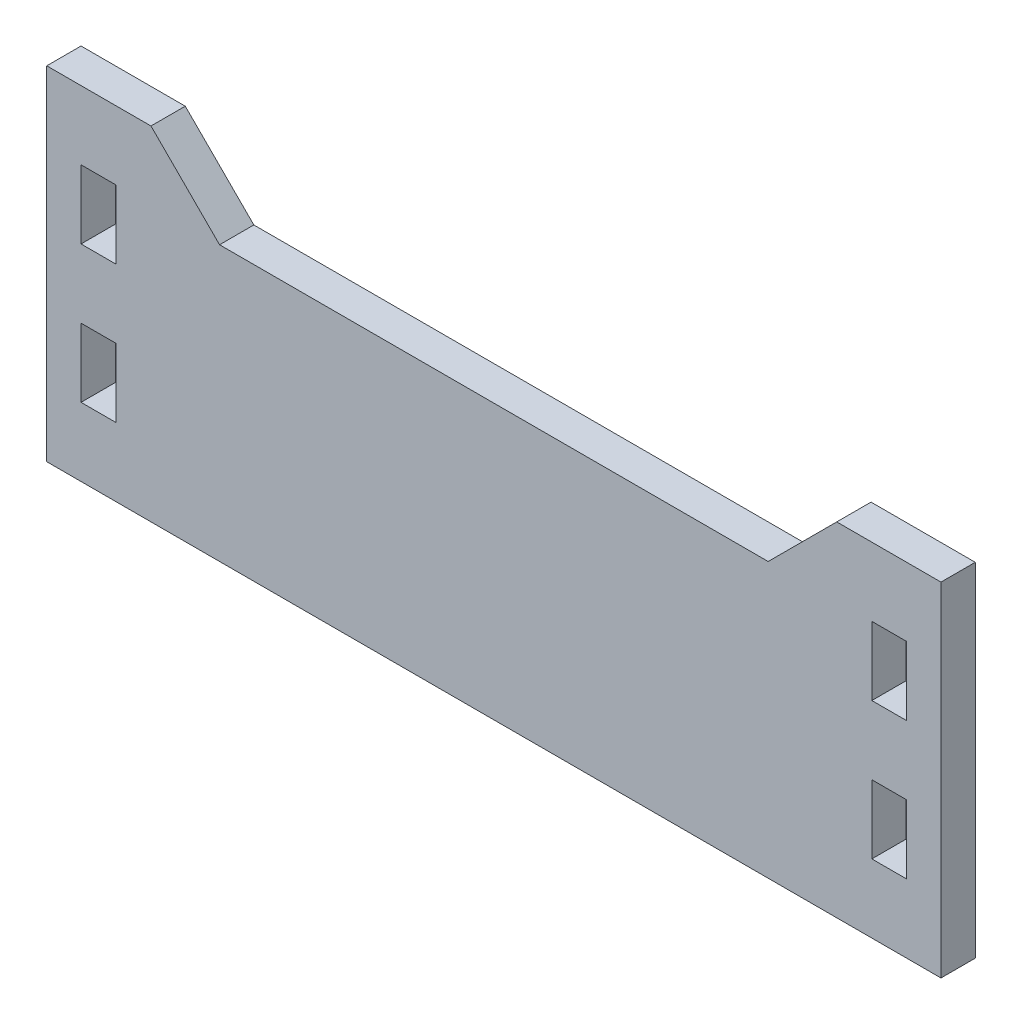
ISO-10303-21;
HEADER;
FILE_DESCRIPTION(('STEP AP214'),'2;1');
FILE_NAME('part.step','',(''),(''),'','','');
FILE_SCHEMA(('AUTOMOTIVE_DESIGN { 1 0 10303 214 1 1 1 1 }'));
ENDSEC;
DATA;
#1=APPLICATION_CONTEXT('core data for automotive mechanical design processes');
#2=APPLICATION_PROTOCOL_DEFINITION('international standard','automotive_design',2000,#1);
#3=PRODUCT_CONTEXT('',#1,'mechanical');
#4=PRODUCT('Part','Part','',(#3));
#5=PRODUCT_RELATED_PRODUCT_CATEGORY('part','',(#4));
#6=PRODUCT_DEFINITION_FORMATION('','',#4);
#7=PRODUCT_DEFINITION_CONTEXT('part definition',#1,'design');
#8=PRODUCT_DEFINITION('design','',#6,#7);
#9=PRODUCT_DEFINITION_SHAPE('','',#8);
#10=(LENGTH_UNIT() NAMED_UNIT(*) SI_UNIT(.MILLI.,.METRE.));
#11=(NAMED_UNIT(*) PLANE_ANGLE_UNIT() SI_UNIT($,.RADIAN.));
#12=(NAMED_UNIT(*) SI_UNIT($,.STERADIAN.) SOLID_ANGLE_UNIT());
#13=UNCERTAINTY_MEASURE_WITH_UNIT(LENGTH_MEASURE(1.E-05),#10,'distance_accuracy_value','');
#14=(GEOMETRIC_REPRESENTATION_CONTEXT(3) GLOBAL_UNCERTAINTY_ASSIGNED_CONTEXT((#13)) GLOBAL_UNIT_ASSIGNED_CONTEXT((#10,
#11,#12)) REPRESENTATION_CONTEXT('',''));
#15=CARTESIAN_POINT('',(0.,0.,0.));
#16=DIRECTION('',(0.,0.,1.));
#17=DIRECTION('',(1.,0.,0.));
#18=AXIS2_PLACEMENT_3D('',#15,#16,#17);
#19=CARTESIAN_POINT('',(-41.402,15.875,3.175));
#20=DIRECTION('',(0.,-1.,0.));
#21=DIRECTION('',(0.,0.,-1.));
#22=AXIS2_PLACEMENT_3D('',#19,#20,#21);
#23=PLANE('',#22);
#24=DIRECTION('',(0.,0.,1.));
#25=VECTOR('',#24,1.);
#26=CARTESIAN_POINT('',(31.75,15.875,0.));
#27=LINE('',#26,#25);
#28=CARTESIAN_POINT('',(31.75,15.875,0.));
#29=VERTEX_POINT('',#28);
#30=CARTESIAN_POINT('',(31.75,15.875,3.175));
#31=VERTEX_POINT('',#30);
#32=EDGE_CURVE('E212',#29,#31,#27,.T.);
#33=ORIENTED_EDGE('',*,*,#32,.T.);
#34=DIRECTION('',(-1.,0.,0.));
#35=VECTOR('',#34,1.);
#36=CARTESIAN_POINT('',(-41.402,15.875,3.175));
#37=LINE('',#36,#35);
#38=CARTESIAN_POINT('',(41.402,15.875,3.175));
#39=VERTEX_POINT('',#38);
#40=EDGE_CURVE('E358',#39,#31,#37,.T.);
#41=ORIENTED_EDGE('',*,*,#40,.F.);
#42=DIRECTION('',(0.,0.,-1.));
#43=VECTOR('',#42,1.);
#44=CARTESIAN_POINT('',(41.402,15.875,3.175));
#45=LINE('',#44,#43);
#46=CARTESIAN_POINT('',(41.402,15.875,0.));
#47=VERTEX_POINT('',#46);
#48=EDGE_CURVE('E11',#39,#47,#45,.T.);
#49=ORIENTED_EDGE('',*,*,#48,.T.);
#50=DIRECTION('',(-1.,0.,0.));
#51=VECTOR('',#50,1.);
#52=CARTESIAN_POINT('',(-41.402,15.875,0.));
#53=LINE('',#52,#51);
#54=EDGE_CURVE('E369',#47,#29,#53,.T.);
#55=ORIENTED_EDGE('',*,*,#54,.T.);
#56=EDGE_LOOP('',(#33,#41,#49,#55));
#57=FACE_BOUND('',#56,.T.);
#58=ADVANCED_FACE('F33',(#57),#23,.F.);
#59=CARTESIAN_POINT('',(41.402,15.875,3.175));
#60=DIRECTION('',(0.,0.,-1.));
#61=DIRECTION('',(-1.,0.,0.));
#62=AXIS2_PLACEMENT_3D('',#59,#60,#61);
#63=PLANE('',#62);
#64=DIRECTION('',(0.,1.,0.));
#65=VECTOR('',#64,1.);
#66=CARTESIAN_POINT('',(35.0012,-3.175,3.175));
#67=LINE('',#66,#65);
#68=CARTESIAN_POINT('',(35.0012,-9.525,3.175));
#69=VERTEX_POINT('',#68);
#70=CARTESIAN_POINT('',(35.0012,-3.175,3.175));
#71=VERTEX_POINT('',#70);
#72=EDGE_CURVE('E56',#69,#71,#67,.T.);
#73=ORIENTED_EDGE('',*,*,#72,.T.);
#74=DIRECTION('',(1.,0.,0.));
#75=VECTOR('',#74,1.);
#76=CARTESIAN_POINT('',(38.227,-3.175,3.175));
#77=LINE('',#76,#75);
#78=CARTESIAN_POINT('',(38.227,-3.175,3.175));
#79=VERTEX_POINT('',#78);
#80=EDGE_CURVE('E233',#71,#79,#77,.T.);
#81=ORIENTED_EDGE('',*,*,#80,.T.);
#82=DIRECTION('',(0.,-1.,0.));
#83=VECTOR('',#82,1.);
#84=CARTESIAN_POINT('',(38.227,-3.175,3.175));
#85=LINE('',#84,#83);
#86=CARTESIAN_POINT('',(38.227,-9.525,3.175));
#87=VERTEX_POINT('',#86);
#88=EDGE_CURVE('E245',#79,#87,#85,.T.);
#89=ORIENTED_EDGE('',*,*,#88,.T.);
#90=DIRECTION('',(-1.,0.,0.));
#91=VECTOR('',#90,1.);
#92=CARTESIAN_POINT('',(38.227,-9.525,3.175));
#93=LINE('',#92,#91);
#94=EDGE_CURVE('E242',#87,#69,#93,.T.);
#95=ORIENTED_EDGE('',*,*,#94,.T.);
#96=EDGE_LOOP('',(#73,#81,#89,#95));
#97=FACE_BOUND('',#96,.T.);
#98=DIRECTION('',(-1.,0.,0.));
#99=VECTOR('',#98,1.);
#100=CARTESIAN_POINT('',(-38.227,9.525,3.175));
#101=LINE('',#100,#99);
#102=CARTESIAN_POINT('',(-35.0012,9.525,3.175));
#103=VERTEX_POINT('',#102);
#104=CARTESIAN_POINT('',(-38.227,9.525,3.175));
#105=VERTEX_POINT('',#104);
#106=EDGE_CURVE('E336',#103,#105,#101,.T.);
#107=ORIENTED_EDGE('',*,*,#106,.F.);
#108=DIRECTION('',(0.,1.,0.));
#109=VECTOR('',#108,1.);
#110=CARTESIAN_POINT('',(-35.0012,9.525,3.175));
#111=LINE('',#110,#109);
#112=CARTESIAN_POINT('',(-35.0012,3.175,3.175));
#113=VERTEX_POINT('',#112);
#114=EDGE_CURVE('E314',#113,#103,#111,.T.);
#115=ORIENTED_EDGE('',*,*,#114,.F.);
#116=DIRECTION('',(1.,0.,0.));
#117=VECTOR('',#116,1.);
#118=CARTESIAN_POINT('',(-38.227,3.175,3.175));
#119=LINE('',#118,#117);
#120=CARTESIAN_POINT('',(-38.227,3.175,3.175));
#121=VERTEX_POINT('',#120);
#122=EDGE_CURVE('E325',#121,#113,#119,.T.);
#123=ORIENTED_EDGE('',*,*,#122,.F.);
#124=DIRECTION('',(0.,-1.,0.));
#125=VECTOR('',#124,1.);
#126=CARTESIAN_POINT('',(-38.227,9.525,3.175));
#127=LINE('',#126,#125);
#128=EDGE_CURVE('E339',#105,#121,#127,.T.);
#129=ORIENTED_EDGE('',*,*,#128,.F.);
#130=EDGE_LOOP('',(#107,#115,#123,#129));
#131=FACE_BOUND('',#130,.T.);
#132=DIRECTION('',(-1.,0.,0.));
#133=VECTOR('',#132,1.);
#134=CARTESIAN_POINT('',(-38.227,-3.175,3.175));
#135=LINE('',#134,#133);
#136=CARTESIAN_POINT('',(-35.0012,-3.175,3.175));
#137=VERTEX_POINT('',#136);
#138=CARTESIAN_POINT('',(-38.227,-3.175,3.175));
#139=VERTEX_POINT('',#138);
#140=EDGE_CURVE('E304',#137,#139,#135,.T.);
#141=ORIENTED_EDGE('',*,*,#140,.F.);
#142=DIRECTION('',(0.,1.,0.));
#143=VECTOR('',#142,1.);
#144=CARTESIAN_POINT('',(-35.0012,-3.175,3.175));
#145=LINE('',#144,#143);
#146=CARTESIAN_POINT('',(-35.0012,-9.525,3.175));
#147=VERTEX_POINT('',#146);
#148=EDGE_CURVE('E282',#147,#137,#145,.T.);
#149=ORIENTED_EDGE('',*,*,#148,.F.);
#150=DIRECTION('',(1.,0.,0.));
#151=VECTOR('',#150,1.);
#152=CARTESIAN_POINT('',(-38.227,-9.525,3.175));
#153=LINE('',#152,#151);
#154=CARTESIAN_POINT('',(-38.227,-9.525,3.175));
#155=VERTEX_POINT('',#154);
#156=EDGE_CURVE('E293',#155,#147,#153,.T.);
#157=ORIENTED_EDGE('',*,*,#156,.F.);
#158=DIRECTION('',(0.,-1.,0.));
#159=VECTOR('',#158,1.);
#160=CARTESIAN_POINT('',(-38.227,-3.175,3.175));
#161=LINE('',#160,#159);
#162=EDGE_CURVE('E307',#139,#155,#161,.T.);
#163=ORIENTED_EDGE('',*,*,#162,.F.);
#164=EDGE_LOOP('',(#141,#149,#157,#163));
#165=FACE_BOUND('',#164,.T.);
#166=DIRECTION('',(0.,1.,0.));
#167=VECTOR('',#166,1.);
#168=CARTESIAN_POINT('',(35.0012,9.525,3.175));
#169=LINE('',#168,#167);
#170=CARTESIAN_POINT('',(35.0012,3.175,3.175));
#171=VERTEX_POINT('',#170);
#172=CARTESIAN_POINT('',(35.0012,9.525,3.175));
#173=VERTEX_POINT('',#172);
#174=EDGE_CURVE('E252',#171,#173,#169,.T.);
#175=ORIENTED_EDGE('',*,*,#174,.T.);
#176=DIRECTION('',(1.,0.,0.));
#177=VECTOR('',#176,1.);
#178=CARTESIAN_POINT('',(38.227,9.525,3.175));
#179=LINE('',#178,#177);
#180=CARTESIAN_POINT('',(38.227,9.525,3.175));
#181=VERTEX_POINT('',#180);
#182=EDGE_CURVE('E261',#173,#181,#179,.T.);
#183=ORIENTED_EDGE('',*,*,#182,.T.);
#184=DIRECTION('',(0.,-1.,0.));
#185=VECTOR('',#184,1.);
#186=CARTESIAN_POINT('',(38.227,9.525,3.175));
#187=LINE('',#186,#185);
#188=CARTESIAN_POINT('',(38.227,3.175,3.175));
#189=VERTEX_POINT('',#188);
#190=EDGE_CURVE('E274',#181,#189,#187,.T.);
#191=ORIENTED_EDGE('',*,*,#190,.T.);
#192=DIRECTION('',(-1.,0.,0.));
#193=VECTOR('',#192,1.);
#194=CARTESIAN_POINT('',(38.227,3.175,3.175));
#195=LINE('',#194,#193);
#196=EDGE_CURVE('E271',#189,#171,#195,.T.);
#197=ORIENTED_EDGE('',*,*,#196,.T.);
#198=EDGE_LOOP('',(#175,#183,#191,#197));
#199=FACE_BOUND('',#198,.T.);
#200=DIRECTION('',(-0.707106781186551,-0.707106781186544,0.));
#201=VECTOR('',#200,1.);
#202=CARTESIAN_POINT('',(25.3999999999999,9.525,3.175));
#203=LINE('',#202,#201);
#204=CARTESIAN_POINT('',(25.3999999999999,9.525,3.175));
#205=VERTEX_POINT('',#204);
#206=EDGE_CURVE('E213',#31,#205,#203,.T.);
#207=ORIENTED_EDGE('',*,*,#206,.T.);
#208=DIRECTION('',(1.,0.,0.));
#209=VECTOR('',#208,1.);
#210=CARTESIAN_POINT('',(0.,9.52500000000001,3.175));
#211=LINE('',#210,#209);
#212=CARTESIAN_POINT('',(-25.3999999999999,9.525,3.175));
#213=VERTEX_POINT('',#212);
#214=EDGE_CURVE('E217',#213,#205,#211,.T.);
#215=ORIENTED_EDGE('',*,*,#214,.F.);
#216=DIRECTION('',(0.707106781186551,-0.707106781186544,0.));
#217=VECTOR('',#216,1.);
#218=CARTESIAN_POINT('',(-25.3999999999999,9.525,3.175));
#219=LINE('',#218,#217);
#220=CARTESIAN_POINT('',(-31.75,15.875,3.175));
#221=VERTEX_POINT('',#220);
#222=EDGE_CURVE('E219',#221,#213,#219,.T.);
#223=ORIENTED_EDGE('',*,*,#222,.F.);
#224=CARTESIAN_POINT('',(-41.402,15.875,3.175));
#225=VERTEX_POINT('',#224);
#226=EDGE_CURVE('E356',#221,#225,#37,.T.);
#227=ORIENTED_EDGE('',*,*,#226,.T.);
#228=DIRECTION('',(0.,-1.,0.));
#229=VECTOR('',#228,1.);
#230=CARTESIAN_POINT('',(-41.402,-15.875,3.175));
#231=LINE('',#230,#229);
#232=CARTESIAN_POINT('',(-41.402,-15.875,3.175));
#233=VERTEX_POINT('',#232);
#234=EDGE_CURVE('E361',#225,#233,#231,.T.);
#235=ORIENTED_EDGE('',*,*,#234,.T.);
#236=DIRECTION('',(1.,0.,0.));
#237=VECTOR('',#236,1.);
#238=CARTESIAN_POINT('',(-41.402,-15.875,3.175));
#239=LINE('',#238,#237);
#240=CARTESIAN_POINT('',(41.402,-15.875,3.175));
#241=VERTEX_POINT('',#240);
#242=EDGE_CURVE('E363',#233,#241,#239,.T.);
#243=ORIENTED_EDGE('',*,*,#242,.T.);
#244=DIRECTION('',(0.,1.,0.));
#245=VECTOR('',#244,1.);
#246=CARTESIAN_POINT('',(41.402,-15.875,3.175));
#247=LINE('',#246,#245);
#248=EDGE_CURVE('E353',#241,#39,#247,.T.);
#249=ORIENTED_EDGE('',*,*,#248,.T.);
#250=ORIENTED_EDGE('',*,*,#40,.T.);
#251=EDGE_LOOP('',(#207,#215,#223,#227,#235,#243,#249,#250));
#252=FACE_BOUND('',#251,.T.);
#253=ADVANCED_FACE('F397',(#97,#131,#165,#199,#252),#63,.F.);
#254=CARTESIAN_POINT('',(41.402,15.875,0.));
#255=DIRECTION('',(0.,0.,-1.));
#256=DIRECTION('',(-1.,0.,0.));
#257=AXIS2_PLACEMENT_3D('',#254,#255,#256);
#258=PLANE('',#257);
#259=DIRECTION('',(1.,0.,0.));
#260=VECTOR('',#259,1.);
#261=CARTESIAN_POINT('',(38.227,-3.175,0.));
#262=LINE('',#261,#260);
#263=CARTESIAN_POINT('',(35.0012,-3.175,0.));
#264=VERTEX_POINT('',#263);
#265=CARTESIAN_POINT('',(38.227,-3.175,0.));
#266=VERTEX_POINT('',#265);
#267=EDGE_CURVE('E238',#264,#266,#262,.T.);
#268=ORIENTED_EDGE('',*,*,#267,.F.);
#269=DIRECTION('',(0.,1.,0.));
#270=VECTOR('',#269,1.);
#271=CARTESIAN_POINT('',(35.0012,-3.175,0.));
#272=LINE('',#271,#270);
#273=CARTESIAN_POINT('',(35.0012,-9.525,0.));
#274=VERTEX_POINT('',#273);
#275=EDGE_CURVE('E230',#274,#264,#272,.T.);
#276=ORIENTED_EDGE('',*,*,#275,.F.);
#277=DIRECTION('',(-1.,0.,0.));
#278=VECTOR('',#277,1.);
#279=CARTESIAN_POINT('',(38.227,-9.525,0.));
#280=LINE('',#279,#278);
#281=CARTESIAN_POINT('',(38.227,-9.525,0.));
#282=VERTEX_POINT('',#281);
#283=EDGE_CURVE('E232',#282,#274,#280,.T.);
#284=ORIENTED_EDGE('',*,*,#283,.F.);
#285=DIRECTION('',(0.,-1.,0.));
#286=VECTOR('',#285,1.);
#287=CARTESIAN_POINT('',(38.227,-3.175,0.));
#288=LINE('',#287,#286);
#289=EDGE_CURVE('E235',#266,#282,#288,.T.);
#290=ORIENTED_EDGE('',*,*,#289,.F.);
#291=EDGE_LOOP('',(#268,#276,#284,#290));
#292=FACE_BOUND('',#291,.T.);
#293=DIRECTION('',(0.,1.,0.));
#294=VECTOR('',#293,1.);
#295=CARTESIAN_POINT('',(-35.0012,9.525,0.));
#296=LINE('',#295,#294);
#297=CARTESIAN_POINT('',(-35.0012,3.175,0.));
#298=VERTEX_POINT('',#297);
#299=CARTESIAN_POINT('',(-35.0012,9.525,0.));
#300=VERTEX_POINT('',#299);
#301=EDGE_CURVE('E321',#298,#300,#296,.T.);
#302=ORIENTED_EDGE('',*,*,#301,.T.);
#303=DIRECTION('',(-1.,0.,0.));
#304=VECTOR('',#303,1.);
#305=CARTESIAN_POINT('',(-38.227,9.525,0.));
#306=LINE('',#305,#304);
#307=CARTESIAN_POINT('',(-38.227,9.525,0.));
#308=VERTEX_POINT('',#307);
#309=EDGE_CURVE('E324',#300,#308,#306,.T.);
#310=ORIENTED_EDGE('',*,*,#309,.T.);
#311=DIRECTION('',(0.,-1.,0.));
#312=VECTOR('',#311,1.);
#313=CARTESIAN_POINT('',(-38.227,9.525,0.));
#314=LINE('',#313,#312);
#315=CARTESIAN_POINT('',(-38.227,3.175,0.));
#316=VERTEX_POINT('',#315);
#317=EDGE_CURVE('E328',#308,#316,#314,.T.);
#318=ORIENTED_EDGE('',*,*,#317,.T.);
#319=DIRECTION('',(1.,0.,0.));
#320=VECTOR('',#319,1.);
#321=CARTESIAN_POINT('',(-38.227,3.175,0.));
#322=LINE('',#321,#320);
#323=EDGE_CURVE('E331',#316,#298,#322,.T.);
#324=ORIENTED_EDGE('',*,*,#323,.T.);
#325=EDGE_LOOP('',(#302,#310,#318,#324));
#326=FACE_BOUND('',#325,.T.);
#327=DIRECTION('',(0.,1.,0.));
#328=VECTOR('',#327,1.);
#329=CARTESIAN_POINT('',(-35.0012,-3.175,0.));
#330=LINE('',#329,#328);
#331=CARTESIAN_POINT('',(-35.0012,-9.525,0.));
#332=VERTEX_POINT('',#331);
#333=CARTESIAN_POINT('',(-35.0012,-3.175,0.));
#334=VERTEX_POINT('',#333);
#335=EDGE_CURVE('E289',#332,#334,#330,.T.);
#336=ORIENTED_EDGE('',*,*,#335,.T.);
#337=DIRECTION('',(-1.,0.,0.));
#338=VECTOR('',#337,1.);
#339=CARTESIAN_POINT('',(-38.227,-3.175,0.));
#340=LINE('',#339,#338);
#341=CARTESIAN_POINT('',(-38.227,-3.175,0.));
#342=VERTEX_POINT('',#341);
#343=EDGE_CURVE('E292',#334,#342,#340,.T.);
#344=ORIENTED_EDGE('',*,*,#343,.T.);
#345=DIRECTION('',(0.,-1.,0.));
#346=VECTOR('',#345,1.);
#347=CARTESIAN_POINT('',(-38.227,-3.175,0.));
#348=LINE('',#347,#346);
#349=CARTESIAN_POINT('',(-38.227,-9.525,0.));
#350=VERTEX_POINT('',#349);
#351=EDGE_CURVE('E296',#342,#350,#348,.T.);
#352=ORIENTED_EDGE('',*,*,#351,.T.);
#353=DIRECTION('',(1.,0.,0.));
#354=VECTOR('',#353,1.);
#355=CARTESIAN_POINT('',(-38.227,-9.525,0.));
#356=LINE('',#355,#354);
#357=EDGE_CURVE('E299',#350,#332,#356,.T.);
#358=ORIENTED_EDGE('',*,*,#357,.T.);
#359=EDGE_LOOP('',(#336,#344,#352,#358));
#360=FACE_BOUND('',#359,.T.);
#361=DIRECTION('',(1.,0.,0.));
#362=VECTOR('',#361,1.);
#363=CARTESIAN_POINT('',(38.227,9.525,0.));
#364=LINE('',#363,#362);
#365=CARTESIAN_POINT('',(35.0012,9.525,0.));
#366=VERTEX_POINT('',#365);
#367=CARTESIAN_POINT('',(38.227,9.525,0.));
#368=VERTEX_POINT('',#367);
#369=EDGE_CURVE('E266',#366,#368,#364,.T.);
#370=ORIENTED_EDGE('',*,*,#369,.F.);
#371=DIRECTION('',(0.,1.,0.));
#372=VECTOR('',#371,1.);
#373=CARTESIAN_POINT('',(35.0012,9.525,0.));
#374=LINE('',#373,#372);
#375=CARTESIAN_POINT('',(35.0012,3.175,0.));
#376=VERTEX_POINT('',#375);
#377=EDGE_CURVE('E258',#376,#366,#374,.T.);
#378=ORIENTED_EDGE('',*,*,#377,.F.);
#379=DIRECTION('',(-1.,0.,0.));
#380=VECTOR('',#379,1.);
#381=CARTESIAN_POINT('',(38.227,3.175,0.));
#382=LINE('',#381,#380);
#383=CARTESIAN_POINT('',(38.227,3.175,0.));
#384=VERTEX_POINT('',#383);
#385=EDGE_CURVE('E260',#384,#376,#382,.T.);
#386=ORIENTED_EDGE('',*,*,#385,.F.);
#387=DIRECTION('',(0.,-1.,0.));
#388=VECTOR('',#387,1.);
#389=CARTESIAN_POINT('',(38.227,9.525,0.));
#390=LINE('',#389,#388);
#391=EDGE_CURVE('E263',#368,#384,#390,.T.);
#392=ORIENTED_EDGE('',*,*,#391,.F.);
#393=EDGE_LOOP('',(#370,#378,#386,#392));
#394=FACE_BOUND('',#393,.T.);
#395=DIRECTION('',(1.,0.,0.));
#396=VECTOR('',#395,1.);
#397=CARTESIAN_POINT('',(0.,9.52500000000001,0.));
#398=LINE('',#397,#396);
#399=CARTESIAN_POINT('',(-25.3999999999999,9.525,0.));
#400=VERTEX_POINT('',#399);
#401=CARTESIAN_POINT('',(25.3999999999999,9.525,0.));
#402=VERTEX_POINT('',#401);
#403=EDGE_CURVE('E196',#400,#402,#398,.T.);
#404=ORIENTED_EDGE('',*,*,#403,.T.);
#405=DIRECTION('',(-0.707106781186551,-0.707106781186544,0.));
#406=VECTOR('',#405,1.);
#407=CARTESIAN_POINT('',(25.3999999999999,9.525,0.));
#408=LINE('',#407,#406);
#409=EDGE_CURVE('E199',#29,#402,#408,.T.);
#410=ORIENTED_EDGE('',*,*,#409,.F.);
#411=ORIENTED_EDGE('',*,*,#54,.F.);
#412=DIRECTION('',(0.,1.,0.));
#413=VECTOR('',#412,1.);
#414=CARTESIAN_POINT('',(41.402,-15.875,0.));
#415=LINE('',#414,#413);
#416=CARTESIAN_POINT('',(41.402,-15.875,0.));
#417=VERTEX_POINT('',#416);
#418=EDGE_CURVE('E346',#417,#47,#415,.T.);
#419=ORIENTED_EDGE('',*,*,#418,.F.);
#420=DIRECTION('',(1.,0.,0.));
#421=VECTOR('',#420,1.);
#422=CARTESIAN_POINT('',(-41.402,-15.875,0.));
#423=LINE('',#422,#421);
#424=CARTESIAN_POINT('',(-41.402,-15.875,0.));
#425=VERTEX_POINT('',#424);
#426=EDGE_CURVE('E357',#425,#417,#423,.T.);
#427=ORIENTED_EDGE('',*,*,#426,.F.);
#428=DIRECTION('',(0.,-1.,0.));
#429=VECTOR('',#428,1.);
#430=CARTESIAN_POINT('',(-41.402,-15.875,0.));
#431=LINE('',#430,#429);
#432=CARTESIAN_POINT('',(-41.402,15.875,0.));
#433=VERTEX_POINT('',#432);
#434=EDGE_CURVE('E371',#433,#425,#431,.T.);
#435=ORIENTED_EDGE('',*,*,#434,.F.);
#436=CARTESIAN_POINT('',(-31.75,15.875,0.));
#437=VERTEX_POINT('',#436);
#438=EDGE_CURVE('E368',#437,#433,#53,.T.);
#439=ORIENTED_EDGE('',*,*,#438,.F.);
#440=DIRECTION('',(0.707106781186551,-0.707106781186544,0.));
#441=VECTOR('',#440,1.);
#442=CARTESIAN_POINT('',(-25.3999999999999,9.525,0.));
#443=LINE('',#442,#441);
#444=EDGE_CURVE('E48',#437,#400,#443,.T.);
#445=ORIENTED_EDGE('',*,*,#444,.T.);
#446=EDGE_LOOP('',(#404,#410,#411,#419,#427,#435,#439,#445));
#447=FACE_BOUND('',#446,.T.);
#448=ADVANCED_FACE('F198',(#292,#326,#360,#394,#447),#258,.T.);
#449=CARTESIAN_POINT('',(41.402,-15.875,3.175));
#450=DIRECTION('',(-1.,0.,0.));
#451=DIRECTION('',(0.,0.,1.));
#452=AXIS2_PLACEMENT_3D('',#449,#450,#451);
#453=PLANE('',#452);
#454=ORIENTED_EDGE('',*,*,#418,.T.);
#455=ORIENTED_EDGE('',*,*,#48,.F.);
#456=ORIENTED_EDGE('',*,*,#248,.F.);
#457=DIRECTION('',(0.,0.,-1.));
#458=VECTOR('',#457,1.);
#459=CARTESIAN_POINT('',(41.402,-15.875,3.175));
#460=LINE('',#459,#458);
#461=EDGE_CURVE('E365',#241,#417,#460,.T.);
#462=ORIENTED_EDGE('',*,*,#461,.T.);
#463=EDGE_LOOP('',(#454,#455,#456,#462));
#464=FACE_BOUND('',#463,.T.);
#465=ADVANCED_FACE('F35',(#464),#453,.F.);
#466=ORIENTED_EDGE('',*,*,#226,.F.);
#467=DIRECTION('',(0.,0.,1.));
#468=VECTOR('',#467,1.);
#469=CARTESIAN_POINT('',(-31.75,15.875,0.));
#470=LINE('',#469,#468);
#471=EDGE_CURVE('E204',#437,#221,#470,.T.);
#472=ORIENTED_EDGE('',*,*,#471,.F.);
#473=ORIENTED_EDGE('',*,*,#438,.T.);
#474=DIRECTION('',(0.,0.,-1.));
#475=VECTOR('',#474,1.);
#476=CARTESIAN_POINT('',(-41.402,15.875,3.175));
#477=LINE('',#476,#475);
#478=EDGE_CURVE('E41',#225,#433,#477,.T.);
#479=ORIENTED_EDGE('',*,*,#478,.F.);
#480=EDGE_LOOP('',(#466,#472,#473,#479));
#481=FACE_BOUND('',#480,.T.);
#482=ADVANCED_FACE('F399',(#481),#23,.F.);
#483=CARTESIAN_POINT('',(-41.402,-15.875,3.175));
#484=DIRECTION('',(1.,0.,0.));
#485=DIRECTION('',(0.,0.,-1.));
#486=AXIS2_PLACEMENT_3D('',#483,#484,#485);
#487=PLANE('',#486);
#488=ORIENTED_EDGE('',*,*,#434,.T.);
#489=DIRECTION('',(0.,0.,-1.));
#490=VECTOR('',#489,1.);
#491=CARTESIAN_POINT('',(-41.402,-15.875,3.175));
#492=LINE('',#491,#490);
#493=EDGE_CURVE('E376',#233,#425,#492,.T.);
#494=ORIENTED_EDGE('',*,*,#493,.F.);
#495=ORIENTED_EDGE('',*,*,#234,.F.);
#496=ORIENTED_EDGE('',*,*,#478,.T.);
#497=EDGE_LOOP('',(#488,#494,#495,#496));
#498=FACE_BOUND('',#497,.T.);
#499=ADVANCED_FACE('F383',(#498),#487,.F.);
#500=CARTESIAN_POINT('',(-41.402,-15.875,3.175));
#501=DIRECTION('',(0.,1.,0.));
#502=DIRECTION('',(0.,0.,1.));
#503=AXIS2_PLACEMENT_3D('',#500,#501,#502);
#504=PLANE('',#503);
#505=ORIENTED_EDGE('',*,*,#426,.T.);
#506=ORIENTED_EDGE('',*,*,#461,.F.);
#507=ORIENTED_EDGE('',*,*,#242,.F.);
#508=ORIENTED_EDGE('',*,*,#493,.T.);
#509=EDGE_LOOP('',(#505,#506,#507,#508));
#510=FACE_BOUND('',#509,.T.);
#511=ADVANCED_FACE('F391',(#510),#504,.F.);
#512=CARTESIAN_POINT('',(-35.0012,9.525,0.));
#513=DIRECTION('',(1.,0.,0.));
#514=DIRECTION('',(0.,0.,-1.));
#515=AXIS2_PLACEMENT_3D('',#512,#513,#514);
#516=PLANE('',#515);
#517=ORIENTED_EDGE('',*,*,#114,.T.);
#518=DIRECTION('',(0.,0.,1.));
#519=VECTOR('',#518,1.);
#520=CARTESIAN_POINT('',(-35.0012,9.525,0.));
#521=LINE('',#520,#519);
#522=EDGE_CURVE('E334',#300,#103,#521,.T.);
#523=ORIENTED_EDGE('',*,*,#522,.F.);
#524=ORIENTED_EDGE('',*,*,#301,.F.);
#525=DIRECTION('',(0.,0.,1.));
#526=VECTOR('',#525,1.);
#527=CARTESIAN_POINT('',(-35.0012,3.175,0.));
#528=LINE('',#527,#526);
#529=EDGE_CURVE('E344',#298,#113,#528,.T.);
#530=ORIENTED_EDGE('',*,*,#529,.T.);
#531=EDGE_LOOP('',(#517,#523,#524,#530));
#532=FACE_BOUND('',#531,.T.);
#533=ADVANCED_FACE('F426',(#532),#516,.F.);
#534=CARTESIAN_POINT('',(-38.227,3.175,0.));
#535=DIRECTION('',(0.,-1.,0.));
#536=DIRECTION('',(0.,0.,-1.));
#537=AXIS2_PLACEMENT_3D('',#534,#535,#536);
#538=PLANE('',#537);
#539=ORIENTED_EDGE('',*,*,#122,.T.);
#540=ORIENTED_EDGE('',*,*,#529,.F.);
#541=ORIENTED_EDGE('',*,*,#323,.F.);
#542=DIRECTION('',(0.,0.,1.));
#543=VECTOR('',#542,1.);
#544=CARTESIAN_POINT('',(-38.227,3.175,0.));
#545=LINE('',#544,#543);
#546=EDGE_CURVE('E347',#316,#121,#545,.T.);
#547=ORIENTED_EDGE('',*,*,#546,.T.);
#548=EDGE_LOOP('',(#539,#540,#541,#547));
#549=FACE_BOUND('',#548,.T.);
#550=ADVANCED_FACE('F430',(#549),#538,.F.);
#551=CARTESIAN_POINT('',(-38.227,9.525,0.));
#552=DIRECTION('',(-1.,0.,0.));
#553=DIRECTION('',(0.,0.,1.));
#554=AXIS2_PLACEMENT_3D('',#551,#552,#553);
#555=PLANE('',#554);
#556=ORIENTED_EDGE('',*,*,#128,.T.);
#557=ORIENTED_EDGE('',*,*,#546,.F.);
#558=ORIENTED_EDGE('',*,*,#317,.F.);
#559=DIRECTION('',(0.,0.,1.));
#560=VECTOR('',#559,1.);
#561=CARTESIAN_POINT('',(-38.227,9.525,0.));
#562=LINE('',#561,#560);
#563=EDGE_CURVE('E349',#308,#105,#562,.T.);
#564=ORIENTED_EDGE('',*,*,#563,.T.);
#565=EDGE_LOOP('',(#556,#557,#558,#564));
#566=FACE_BOUND('',#565,.T.);
#567=ADVANCED_FACE('F435',(#566),#555,.F.);
#568=CARTESIAN_POINT('',(-38.227,9.525,0.));
#569=DIRECTION('',(0.,1.,0.));
#570=DIRECTION('',(-1.,0.,0.));
#571=AXIS2_PLACEMENT_3D('',#568,#569,#570);
#572=PLANE('',#571);
#573=ORIENTED_EDGE('',*,*,#106,.T.);
#574=ORIENTED_EDGE('',*,*,#563,.F.);
#575=ORIENTED_EDGE('',*,*,#309,.F.);
#576=ORIENTED_EDGE('',*,*,#522,.T.);
#577=EDGE_LOOP('',(#573,#574,#575,#576));
#578=FACE_BOUND('',#577,.T.);
#579=ADVANCED_FACE('F439',(#578),#572,.F.);
#580=CARTESIAN_POINT('',(-35.0012,-3.175,0.));
#581=DIRECTION('',(1.,0.,0.));
#582=DIRECTION('',(0.,0.,-1.));
#583=AXIS2_PLACEMENT_3D('',#580,#581,#582);
#584=PLANE('',#583);
#585=ORIENTED_EDGE('',*,*,#148,.T.);
#586=DIRECTION('',(0.,0.,1.));
#587=VECTOR('',#586,1.);
#588=CARTESIAN_POINT('',(-35.0012,-3.175,0.));
#589=LINE('',#588,#587);
#590=EDGE_CURVE('E302',#334,#137,#589,.T.);
#591=ORIENTED_EDGE('',*,*,#590,.F.);
#592=ORIENTED_EDGE('',*,*,#335,.F.);
#593=DIRECTION('',(0.,0.,1.));
#594=VECTOR('',#593,1.);
#595=CARTESIAN_POINT('',(-35.0012,-9.525,0.));
#596=LINE('',#595,#594);
#597=EDGE_CURVE('E312',#332,#147,#596,.T.);
#598=ORIENTED_EDGE('',*,*,#597,.T.);
#599=EDGE_LOOP('',(#585,#591,#592,#598));
#600=FACE_BOUND('',#599,.T.);
#601=ADVANCED_FACE('F442',(#600),#584,.F.);
#602=CARTESIAN_POINT('',(-38.227,-9.525,0.));
#603=DIRECTION('',(0.,-1.,0.));
#604=DIRECTION('',(0.,0.,-1.));
#605=AXIS2_PLACEMENT_3D('',#602,#603,#604);
#606=PLANE('',#605);
#607=ORIENTED_EDGE('',*,*,#156,.T.);
#608=ORIENTED_EDGE('',*,*,#597,.F.);
#609=ORIENTED_EDGE('',*,*,#357,.F.);
#610=DIRECTION('',(0.,0.,1.));
#611=VECTOR('',#610,1.);
#612=CARTESIAN_POINT('',(-38.227,-9.525,0.));
#613=LINE('',#612,#611);
#614=EDGE_CURVE('E315',#350,#155,#613,.T.);
#615=ORIENTED_EDGE('',*,*,#614,.T.);
#616=EDGE_LOOP('',(#607,#608,#609,#615));
#617=FACE_BOUND('',#616,.T.);
#618=ADVANCED_FACE('F449',(#617),#606,.F.);
#619=CARTESIAN_POINT('',(-38.227,-3.175,0.));
#620=DIRECTION('',(-1.,0.,0.));
#621=DIRECTION('',(0.,0.,1.));
#622=AXIS2_PLACEMENT_3D('',#619,#620,#621);
#623=PLANE('',#622);
#624=ORIENTED_EDGE('',*,*,#162,.T.);
#625=ORIENTED_EDGE('',*,*,#614,.F.);
#626=ORIENTED_EDGE('',*,*,#351,.F.);
#627=DIRECTION('',(0.,0.,1.));
#628=VECTOR('',#627,1.);
#629=CARTESIAN_POINT('',(-38.227,-3.175,0.));
#630=LINE('',#629,#628);
#631=EDGE_CURVE('E317',#342,#139,#630,.T.);
#632=ORIENTED_EDGE('',*,*,#631,.T.);
#633=EDGE_LOOP('',(#624,#625,#626,#632));
#634=FACE_BOUND('',#633,.T.);
#635=ADVANCED_FACE('F455',(#634),#623,.F.);
#636=CARTESIAN_POINT('',(-38.227,-3.175,0.));
#637=DIRECTION('',(0.,1.,0.));
#638=DIRECTION('',(0.,0.,1.));
#639=AXIS2_PLACEMENT_3D('',#636,#637,#638);
#640=PLANE('',#639);
#641=ORIENTED_EDGE('',*,*,#140,.T.);
#642=ORIENTED_EDGE('',*,*,#631,.F.);
#643=ORIENTED_EDGE('',*,*,#343,.F.);
#644=ORIENTED_EDGE('',*,*,#590,.T.);
#645=EDGE_LOOP('',(#641,#642,#643,#644));
#646=FACE_BOUND('',#645,.T.);
#647=ADVANCED_FACE('F451',(#646),#640,.F.);
#648=CARTESIAN_POINT('',(35.0012,9.525,0.));
#649=DIRECTION('',(1.,0.,0.));
#650=DIRECTION('',(0.,0.,-1.));
#651=AXIS2_PLACEMENT_3D('',#648,#649,#650);
#652=PLANE('',#651);
#653=ORIENTED_EDGE('',*,*,#174,.F.);
#654=DIRECTION('',(0.,0.,1.));
#655=VECTOR('',#654,1.);
#656=CARTESIAN_POINT('',(35.0012,3.175,0.));
#657=LINE('',#656,#655);
#658=EDGE_CURVE('E268',#376,#171,#657,.T.);
#659=ORIENTED_EDGE('',*,*,#658,.F.);
#660=ORIENTED_EDGE('',*,*,#377,.T.);
#661=DIRECTION('',(0.,0.,1.));
#662=VECTOR('',#661,1.);
#663=CARTESIAN_POINT('',(35.0012,9.525,0.));
#664=LINE('',#663,#662);
#665=EDGE_CURVE('E279',#366,#173,#664,.T.);
#666=ORIENTED_EDGE('',*,*,#665,.T.);
#667=EDGE_LOOP('',(#653,#659,#660,#666));
#668=FACE_BOUND('',#667,.T.);
#669=ADVANCED_FACE('F454',(#668),#652,.T.);
#670=CARTESIAN_POINT('',(38.227,9.525,0.));
#671=DIRECTION('',(0.,-1.,0.));
#672=DIRECTION('',(1.,0.,0.));
#673=AXIS2_PLACEMENT_3D('',#670,#671,#672);
#674=PLANE('',#673);
#675=ORIENTED_EDGE('',*,*,#182,.F.);
#676=ORIENTED_EDGE('',*,*,#665,.F.);
#677=ORIENTED_EDGE('',*,*,#369,.T.);
#678=DIRECTION('',(0.,0.,1.));
#679=VECTOR('',#678,1.);
#680=CARTESIAN_POINT('',(38.227,9.525,0.));
#681=LINE('',#680,#679);
#682=EDGE_CURVE('E283',#368,#181,#681,.T.);
#683=ORIENTED_EDGE('',*,*,#682,.T.);
#684=EDGE_LOOP('',(#675,#676,#677,#683));
#685=FACE_BOUND('',#684,.T.);
#686=ADVANCED_FACE('F465',(#685),#674,.T.);
#687=CARTESIAN_POINT('',(38.227,9.525,0.));
#688=DIRECTION('',(-1.,0.,0.));
#689=DIRECTION('',(0.,0.,1.));
#690=AXIS2_PLACEMENT_3D('',#687,#688,#689);
#691=PLANE('',#690);
#692=ORIENTED_EDGE('',*,*,#190,.F.);
#693=ORIENTED_EDGE('',*,*,#682,.F.);
#694=ORIENTED_EDGE('',*,*,#391,.T.);
#695=DIRECTION('',(0.,0.,1.));
#696=VECTOR('',#695,1.);
#697=CARTESIAN_POINT('',(38.227,3.175,0.));
#698=LINE('',#697,#696);
#699=EDGE_CURVE('E285',#384,#189,#698,.T.);
#700=ORIENTED_EDGE('',*,*,#699,.T.);
#701=EDGE_LOOP('',(#692,#693,#694,#700));
#702=FACE_BOUND('',#701,.T.);
#703=ADVANCED_FACE('F471',(#702),#691,.T.);
#704=CARTESIAN_POINT('',(38.227,3.175,0.));
#705=DIRECTION('',(0.,1.,0.));
#706=DIRECTION('',(0.,0.,1.));
#707=AXIS2_PLACEMENT_3D('',#704,#705,#706);
#708=PLANE('',#707);
#709=ORIENTED_EDGE('',*,*,#196,.F.);
#710=ORIENTED_EDGE('',*,*,#699,.F.);
#711=ORIENTED_EDGE('',*,*,#385,.T.);
#712=ORIENTED_EDGE('',*,*,#658,.T.);
#713=EDGE_LOOP('',(#709,#710,#711,#712));
#714=FACE_BOUND('',#713,.T.);
#715=ADVANCED_FACE('F467',(#714),#708,.T.);
#716=CARTESIAN_POINT('',(35.0012,-3.175,0.));
#717=DIRECTION('',(1.,0.,0.));
#718=DIRECTION('',(0.,0.,-1.));
#719=AXIS2_PLACEMENT_3D('',#716,#717,#718);
#720=PLANE('',#719);
#721=ORIENTED_EDGE('',*,*,#72,.F.);
#722=DIRECTION('',(0.,0.,1.));
#723=VECTOR('',#722,1.);
#724=CARTESIAN_POINT('',(35.0012,-9.525,0.));
#725=LINE('',#724,#723);
#726=EDGE_CURVE('E240',#274,#69,#725,.T.);
#727=ORIENTED_EDGE('',*,*,#726,.F.);
#728=ORIENTED_EDGE('',*,*,#275,.T.);
#729=DIRECTION('',(0.,0.,1.));
#730=VECTOR('',#729,1.);
#731=CARTESIAN_POINT('',(35.0012,-3.175,0.));
#732=LINE('',#731,#730);
#733=EDGE_CURVE('E250',#264,#71,#732,.T.);
#734=ORIENTED_EDGE('',*,*,#733,.T.);
#735=EDGE_LOOP('',(#721,#727,#728,#734));
#736=FACE_BOUND('',#735,.T.);
#737=ADVANCED_FACE('F470',(#736),#720,.T.);
#738=CARTESIAN_POINT('',(38.227,-3.175,0.));
#739=DIRECTION('',(0.,-1.,0.));
#740=DIRECTION('',(0.,0.,-1.));
#741=AXIS2_PLACEMENT_3D('',#738,#739,#740);
#742=PLANE('',#741);
#743=ORIENTED_EDGE('',*,*,#80,.F.);
#744=ORIENTED_EDGE('',*,*,#733,.F.);
#745=ORIENTED_EDGE('',*,*,#267,.T.);
#746=DIRECTION('',(0.,0.,1.));
#747=VECTOR('',#746,1.);
#748=CARTESIAN_POINT('',(38.227,-3.175,0.));
#749=LINE('',#748,#747);
#750=EDGE_CURVE('E253',#266,#79,#749,.T.);
#751=ORIENTED_EDGE('',*,*,#750,.T.);
#752=EDGE_LOOP('',(#743,#744,#745,#751));
#753=FACE_BOUND('',#752,.T.);
#754=ADVANCED_FACE('F481',(#753),#742,.T.);
#755=CARTESIAN_POINT('',(38.227,-3.175,0.));
#756=DIRECTION('',(-1.,0.,0.));
#757=DIRECTION('',(0.,0.,1.));
#758=AXIS2_PLACEMENT_3D('',#755,#756,#757);
#759=PLANE('',#758);
#760=ORIENTED_EDGE('',*,*,#88,.F.);
#761=ORIENTED_EDGE('',*,*,#750,.F.);
#762=ORIENTED_EDGE('',*,*,#289,.T.);
#763=DIRECTION('',(0.,0.,1.));
#764=VECTOR('',#763,1.);
#765=CARTESIAN_POINT('',(38.227,-9.525,0.));
#766=LINE('',#765,#764);
#767=EDGE_CURVE('E255',#282,#87,#766,.T.);
#768=ORIENTED_EDGE('',*,*,#767,.T.);
#769=EDGE_LOOP('',(#760,#761,#762,#768));
#770=FACE_BOUND('',#769,.T.);
#771=ADVANCED_FACE('F485',(#770),#759,.T.);
#772=CARTESIAN_POINT('',(38.227,-9.525,0.));
#773=DIRECTION('',(0.,1.,0.));
#774=DIRECTION('',(0.,0.,1.));
#775=AXIS2_PLACEMENT_3D('',#772,#773,#774);
#776=PLANE('',#775);
#777=ORIENTED_EDGE('',*,*,#94,.F.);
#778=ORIENTED_EDGE('',*,*,#767,.F.);
#779=ORIENTED_EDGE('',*,*,#283,.T.);
#780=ORIENTED_EDGE('',*,*,#726,.T.);
#781=EDGE_LOOP('',(#777,#778,#779,#780));
#782=FACE_BOUND('',#781,.T.);
#783=ADVANCED_FACE('F482',(#782),#776,.T.);
#784=CARTESIAN_POINT('',(0.,9.52500000000001,0.));
#785=DIRECTION('',(0.,-1.,0.));
#786=DIRECTION('',(1.,0.,0.));
#787=AXIS2_PLACEMENT_3D('',#784,#785,#786);
#788=PLANE('',#787);
#789=ORIENTED_EDGE('',*,*,#214,.T.);
#790=DIRECTION('',(0.,0.,1.));
#791=VECTOR('',#790,1.);
#792=CARTESIAN_POINT('',(25.3999999999999,9.525,0.));
#793=LINE('',#792,#791);
#794=EDGE_CURVE('E209',#402,#205,#793,.T.);
#795=ORIENTED_EDGE('',*,*,#794,.F.);
#796=ORIENTED_EDGE('',*,*,#403,.F.);
#797=DIRECTION('',(0.,0.,1.));
#798=VECTOR('',#797,1.);
#799=CARTESIAN_POINT('',(-25.3999999999999,9.525,0.));
#800=LINE('',#799,#798);
#801=EDGE_CURVE('E227',#400,#213,#800,.T.);
#802=ORIENTED_EDGE('',*,*,#801,.T.);
#803=EDGE_LOOP('',(#789,#795,#796,#802));
#804=FACE_BOUND('',#803,.T.);
#805=ADVANCED_FACE('F215',(#804),#788,.F.);
#806=CARTESIAN_POINT('',(-25.3999999999999,9.525,0.));
#807=DIRECTION('',(-0.707106781186544,-0.707106781186551,0.));
#808=DIRECTION('',(0.707106781186551,-0.707106781186544,0.));
#809=AXIS2_PLACEMENT_3D('',#806,#807,#808);
#810=PLANE('',#809);
#811=ORIENTED_EDGE('',*,*,#222,.T.);
#812=ORIENTED_EDGE('',*,*,#801,.F.);
#813=ORIENTED_EDGE('',*,*,#444,.F.);
#814=ORIENTED_EDGE('',*,*,#471,.T.);
#815=EDGE_LOOP('',(#811,#812,#813,#814));
#816=FACE_BOUND('',#815,.T.);
#817=ADVANCED_FACE('F400',(#816),#810,.F.);
#818=CARTESIAN_POINT('',(25.3999999999999,9.525,0.));
#819=DIRECTION('',(-0.707106781186544,0.707106781186551,0.));
#820=DIRECTION('',(-0.707106781186551,-0.707106781186544,0.));
#821=AXIS2_PLACEMENT_3D('',#818,#819,#820);
#822=PLANE('',#821);
#823=ORIENTED_EDGE('',*,*,#206,.F.);
#824=ORIENTED_EDGE('',*,*,#32,.F.);
#825=ORIENTED_EDGE('',*,*,#409,.T.);
#826=ORIENTED_EDGE('',*,*,#794,.T.);
#827=EDGE_LOOP('',(#823,#824,#825,#826));
#828=FACE_BOUND('',#827,.T.);
#829=ADVANCED_FACE('F208',(#828),#822,.T.);
#830=CLOSED_SHELL('',(#58,#253,#448,#465,#482,#499,#511,#533,#550,#567,#579,#601,#618,#635,#647,
#669,#686,#703,#715,#737,#754,#771,#783,#805,#817,#829));
#831=MANIFOLD_SOLID_BREP('B2',#830);
#832=ADVANCED_BREP_SHAPE_REPRESENTATION('',(#18,#831),#14);
#833=SHAPE_DEFINITION_REPRESENTATION(#9,#832);
ENDSEC;
END-ISO-10303-21;
